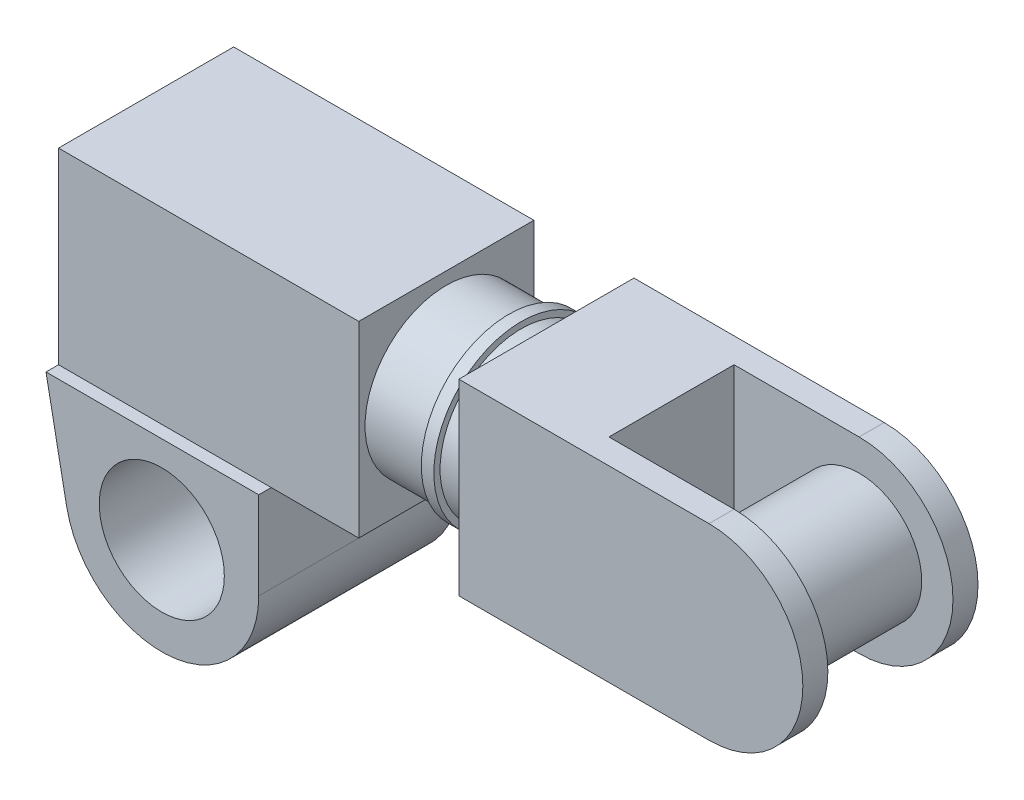
ISO-10303-21;
HEADER;
FILE_DESCRIPTION(('STEP AP214'),'2;1');
FILE_NAME('part.step','',(''),(''),'','','');
FILE_SCHEMA(('AUTOMOTIVE_DESIGN { 1 0 10303 214 1 1 1 1 }'));
ENDSEC;
DATA;
#1=APPLICATION_CONTEXT('core data for automotive mechanical design processes');
#2=APPLICATION_PROTOCOL_DEFINITION('international standard','automotive_design',2000,#1);
#3=PRODUCT_CONTEXT('',#1,'mechanical');
#4=PRODUCT('Part','Part','',(#3));
#5=PRODUCT_RELATED_PRODUCT_CATEGORY('part','',(#4));
#6=PRODUCT_DEFINITION_FORMATION('','',#4);
#7=PRODUCT_DEFINITION_CONTEXT('part definition',#1,'design');
#8=PRODUCT_DEFINITION('design','',#6,#7);
#9=PRODUCT_DEFINITION_SHAPE('','',#8);
#10=(LENGTH_UNIT() NAMED_UNIT(*) SI_UNIT(.MILLI.,.METRE.));
#11=(NAMED_UNIT(*) PLANE_ANGLE_UNIT() SI_UNIT($,.RADIAN.));
#12=(NAMED_UNIT(*) SI_UNIT($,.STERADIAN.) SOLID_ANGLE_UNIT());
#13=UNCERTAINTY_MEASURE_WITH_UNIT(LENGTH_MEASURE(1.E-05),#10,'distance_accuracy_value','');
#14=(GEOMETRIC_REPRESENTATION_CONTEXT(3) GLOBAL_UNCERTAINTY_ASSIGNED_CONTEXT((#13)) GLOBAL_UNIT_ASSIGNED_CONTEXT((#10,
#11,#12)) REPRESENTATION_CONTEXT('',''));
#15=CARTESIAN_POINT('',(0.,0.,0.));
#16=DIRECTION('',(0.,0.,1.));
#17=DIRECTION('',(1.,0.,0.));
#18=AXIS2_PLACEMENT_3D('',#15,#16,#17);
#19=CARTESIAN_POINT('',(240.,75.,-70.));
#20=DIRECTION('',(1.,0.,0.));
#21=DIRECTION('',(0.,0.,-1.));
#22=AXIS2_PLACEMENT_3D('',#19,#20,#21);
#23=PLANE('',#22);
#24=DIRECTION('',(0.,1.,0.));
#25=VECTOR('',#24,1.);
#26=CARTESIAN_POINT('',(240.,75.,-70.));
#27=LINE('',#26,#25);
#28=CARTESIAN_POINT('',(240.,-75.,-70.));
#29=VERTEX_POINT('',#28);
#30=CARTESIAN_POINT('',(240.,75.,-70.));
#31=VERTEX_POINT('',#30);
#32=EDGE_CURVE('E163',#29,#31,#27,.T.);
#33=ORIENTED_EDGE('',*,*,#32,.T.);
#34=DIRECTION('',(0.,0.,1.));
#35=VECTOR('',#34,1.);
#36=CARTESIAN_POINT('',(240.,75.,70.));
#37=LINE('',#36,#35);
#38=CARTESIAN_POINT('',(240.,75.,70.));
#39=VERTEX_POINT('',#38);
#40=EDGE_CURVE('E189',#31,#39,#37,.T.);
#41=ORIENTED_EDGE('',*,*,#40,.T.);
#42=DIRECTION('',(0.,-1.,0.));
#43=VECTOR('',#42,1.);
#44=CARTESIAN_POINT('',(240.,75.,70.));
#45=LINE('',#44,#43);
#46=CARTESIAN_POINT('',(240.,-75.,70.));
#47=VERTEX_POINT('',#46);
#48=EDGE_CURVE('E186',#39,#47,#45,.T.);
#49=ORIENTED_EDGE('',*,*,#48,.T.);
#50=DIRECTION('',(0.,0.,-1.));
#51=VECTOR('',#50,1.);
#52=CARTESIAN_POINT('',(240.,-75.,70.));
#53=LINE('',#52,#51);
#54=EDGE_CURVE('E147',#47,#29,#53,.T.);
#55=ORIENTED_EDGE('',*,*,#54,.T.);
#56=EDGE_LOOP('',(#33,#41,#49,#55));
#57=FACE_BOUND('',#56,.T.);
#58=ADVANCED_FACE('F51',(#57),#23,.T.);
#59=CARTESIAN_POINT('',(240.,75.,-70.));
#60=DIRECTION('',(0.,0.,1.));
#61=DIRECTION('',(0.,-1.,0.));
#62=AXIS2_PLACEMENT_3D('',#59,#60,#61);
#63=PLANE('',#62);
#64=DIRECTION('',(0.,1.,0.));
#65=VECTOR('',#64,1.);
#66=CARTESIAN_POINT('',(0.,75.,-70.));
#67=LINE('',#66,#65);
#68=CARTESIAN_POINT('',(0.,-75.,-70.));
#69=VERTEX_POINT('',#68);
#70=CARTESIAN_POINT('',(0.,75.,-70.));
#71=VERTEX_POINT('',#70);
#72=EDGE_CURVE('E180',#69,#71,#67,.T.);
#73=ORIENTED_EDGE('',*,*,#72,.T.);
#74=DIRECTION('',(-1.,0.,0.));
#75=VECTOR('',#74,1.);
#76=CARTESIAN_POINT('',(240.,75.,-70.));
#77=LINE('',#76,#75);
#78=EDGE_CURVE('E159',#31,#71,#77,.T.);
#79=ORIENTED_EDGE('',*,*,#78,.F.);
#80=ORIENTED_EDGE('',*,*,#32,.F.);
#81=DIRECTION('',(-1.,0.,0.));
#82=VECTOR('',#81,1.);
#83=CARTESIAN_POINT('',(240.,-75.,-70.));
#84=LINE('',#83,#82);
#85=CARTESIAN_POINT('',(170.057165498669,-75.,-70.));
#86=VERTEX_POINT('',#85);
#87=EDGE_CURVE('E148',#29,#86,#84,.T.);
#88=ORIENTED_EDGE('',*,*,#87,.T.);
#89=EDGE_CURVE('E140',#86,#69,#84,.T.);
#90=ORIENTED_EDGE('',*,*,#89,.T.);
#91=EDGE_LOOP('',(#73,#79,#80,#88,#90));
#92=FACE_BOUND('',#91,.T.);
#93=ADVANCED_FACE('F160',(#92),#63,.F.);
#94=CARTESIAN_POINT('',(240.,75.,70.));
#95=DIRECTION('',(0.,-1.,0.));
#96=DIRECTION('',(0.,0.,-1.));
#97=AXIS2_PLACEMENT_3D('',#94,#95,#96);
#98=PLANE('',#97);
#99=DIRECTION('',(0.,0.,1.));
#100=VECTOR('',#99,1.);
#101=CARTESIAN_POINT('',(0.,75.,70.));
#102=LINE('',#101,#100);
#103=CARTESIAN_POINT('',(0.,75.,70.));
#104=VERTEX_POINT('',#103);
#105=EDGE_CURVE('E177',#71,#104,#102,.T.);
#106=ORIENTED_EDGE('',*,*,#105,.T.);
#107=DIRECTION('',(-1.,0.,0.));
#108=VECTOR('',#107,1.);
#109=CARTESIAN_POINT('',(240.,75.,70.));
#110=LINE('',#109,#108);
#111=EDGE_CURVE('E240',#39,#104,#110,.T.);
#112=ORIENTED_EDGE('',*,*,#111,.F.);
#113=ORIENTED_EDGE('',*,*,#40,.F.);
#114=ORIENTED_EDGE('',*,*,#78,.T.);
#115=EDGE_LOOP('',(#106,#112,#113,#114));
#116=FACE_BOUND('',#115,.T.);
#117=ADVANCED_FACE('F249',(#116),#98,.F.);
#118=CARTESIAN_POINT('',(240.,75.,70.));
#119=DIRECTION('',(0.,0.,-1.));
#120=DIRECTION('',(0.,1.,0.));
#121=AXIS2_PLACEMENT_3D('',#118,#119,#120);
#122=PLANE('',#121);
#123=DIRECTION('',(0.,-1.,0.));
#124=VECTOR('',#123,1.);
#125=CARTESIAN_POINT('',(0.,75.,70.));
#126=LINE('',#125,#124);
#127=CARTESIAN_POINT('',(0.,-75.,70.));
#128=VERTEX_POINT('',#127);
#129=EDGE_CURVE('E173',#104,#128,#126,.T.);
#130=ORIENTED_EDGE('',*,*,#129,.T.);
#131=DIRECTION('',(-1.,0.,0.));
#132=VECTOR('',#131,1.);
#133=CARTESIAN_POINT('',(240.,-75.,70.));
#134=LINE('',#133,#132);
#135=CARTESIAN_POINT('',(170.057165498669,-75.,70.));
#136=VERTEX_POINT('',#135);
#137=EDGE_CURVE('E165',#136,#128,#134,.T.);
#138=ORIENTED_EDGE('',*,*,#137,.F.);
#139=EDGE_CURVE('E157',#47,#136,#134,.T.);
#140=ORIENTED_EDGE('',*,*,#139,.F.);
#141=ORIENTED_EDGE('',*,*,#48,.F.);
#142=ORIENTED_EDGE('',*,*,#111,.T.);
#143=EDGE_LOOP('',(#130,#138,#140,#141,#142));
#144=FACE_BOUND('',#143,.T.);
#145=ADVANCED_FACE('F237',(#144),#122,.F.);
#146=CARTESIAN_POINT('',(240.,-75.,70.));
#147=DIRECTION('',(0.,1.,0.));
#148=DIRECTION('',(0.,0.,1.));
#149=AXIS2_PLACEMENT_3D('',#146,#147,#148);
#150=PLANE('',#149);
#151=ORIENTED_EDGE('',*,*,#139,.T.);
#152=DIRECTION('',(0.,0.,-1.));
#153=VECTOR('',#152,1.);
#154=CARTESIAN_POINT('',(170.057165498669,-75.,80.));
#155=LINE('',#154,#153);
#156=EDGE_CURVE('E129',#136,#86,#155,.T.);
#157=ORIENTED_EDGE('',*,*,#156,.T.);
#158=ORIENTED_EDGE('',*,*,#87,.F.);
#159=ORIENTED_EDGE('',*,*,#54,.F.);
#160=EDGE_LOOP('',(#151,#157,#158,#159));
#161=FACE_BOUND('',#160,.T.);
#162=ADVANCED_FACE('F153',(#161),#150,.F.);
#163=CARTESIAN_POINT('',(0.,0.,0.));
#164=DIRECTION('',(1.,0.,0.));
#165=DIRECTION('',(0.,0.,-1.));
#166=AXIS2_PLACEMENT_3D('',#163,#164,#165);
#167=PLANE('',#166);
#168=ORIENTED_EDGE('',*,*,#72,.F.);
#169=DIRECTION('',(0.,0.,-1.));
#170=VECTOR('',#169,1.);
#171=CARTESIAN_POINT('',(0.,-75.,70.));
#172=LINE('',#171,#170);
#173=EDGE_CURVE('E170',#128,#69,#172,.T.);
#174=ORIENTED_EDGE('',*,*,#173,.F.);
#175=ORIENTED_EDGE('',*,*,#129,.F.);
#176=ORIENTED_EDGE('',*,*,#105,.F.);
#177=EDGE_LOOP('',(#168,#174,#175,#176));
#178=FACE_BOUND('',#177,.T.);
#179=ADVANCED_FACE('F242',(#178),#167,.F.);
#180=CARTESIAN_POINT('',(0.,-75.,80.));
#181=DIRECTION('',(0.,-1.,0.));
#182=DIRECTION('',(0.,0.,-1.));
#183=AXIS2_PLACEMENT_3D('',#180,#181,#182);
#184=PLANE('',#183);
#185=CARTESIAN_POINT('',(170.057165498669,-75.,80.));
#186=VERTEX_POINT('',#185);
#187=EDGE_CURVE('E137',#186,#136,#155,.T.);
#188=ORIENTED_EDGE('',*,*,#187,.T.);
#189=ORIENTED_EDGE('',*,*,#137,.T.);
#190=DIRECTION('',(0.,0.,-1.));
#191=VECTOR('',#190,1.);
#192=CARTESIAN_POINT('',(0.,-75.,80.));
#193=LINE('',#192,#191);
#194=CARTESIAN_POINT('',(0.,-75.,80.));
#195=VERTEX_POINT('',#194);
#196=EDGE_CURVE('E183',#195,#128,#193,.T.);
#197=ORIENTED_EDGE('',*,*,#196,.F.);
#198=DIRECTION('',(-1.,0.,0.));
#199=VECTOR('',#198,1.);
#200=CARTESIAN_POINT('',(0.,-75.,80.));
#201=LINE('',#200,#199);
#202=EDGE_CURVE('E207',#186,#195,#201,.T.);
#203=ORIENTED_EDGE('',*,*,#202,.F.);
#204=EDGE_LOOP('',(#188,#189,#197,#203));
#205=FACE_BOUND('',#204,.T.);
#206=ADVANCED_FACE('F230',(#205),#184,.F.);
#207=CARTESIAN_POINT('',(92.5571654986695,-145.,80.));
#208=DIRECTION('',(0.,0.,1.));
#209=DIRECTION('',(1.,0.,0.));
#210=AXIS2_PLACEMENT_3D('',#207,#208,#209);
#211=PLANE('',#210);
#212=ORIENTED_EDGE('',*,*,#202,.T.);
#213=DIRECTION('',(0.190808995376545,-0.981627183447664,0.));
#214=VECTOR('',#213,1.);
#215=CARTESIAN_POINT('',(0.,-75.,80.));
#216=LINE('',#215,#214);
#217=CARTESIAN_POINT('',(16.4810587814755,-159.787697141682,80.));
#218=VERTEX_POINT('',#217);
#219=EDGE_CURVE('E85',#195,#218,#216,.T.);
#220=ORIENTED_EDGE('',*,*,#219,.T.);
#221=CARTESIAN_POINT('',(92.5571654986695,-145.,80.));
#222=DIRECTION('',(0.,0.,1.));
#223=DIRECTION('',(1.,0.,0.));
#224=AXIS2_PLACEMENT_3D('',#221,#222,#223);
#225=CIRCLE('',#224,77.5);
#226=CARTESIAN_POINT('',(170.057165498669,-145.,80.));
#227=VERTEX_POINT('',#226);
#228=EDGE_CURVE('E218',#218,#227,#225,.T.);
#229=ORIENTED_EDGE('',*,*,#228,.T.);
#230=DIRECTION('',(0.,1.,0.));
#231=VECTOR('',#230,1.);
#232=CARTESIAN_POINT('',(170.057165498669,-75.,80.));
#233=LINE('',#232,#231);
#234=EDGE_CURVE('E136',#227,#186,#233,.T.);
#235=ORIENTED_EDGE('',*,*,#234,.T.);
#236=EDGE_LOOP('',(#212,#220,#229,#235));
#237=FACE_BOUND('',#236,.T.);
#238=CARTESIAN_POINT('',(92.5571654986695,-145.,80.));
#239=DIRECTION('',(0.,0.,1.));
#240=DIRECTION('',(1.,0.,0.));
#241=AXIS2_PLACEMENT_3D('',#238,#239,#240);
#242=CIRCLE('',#241,50.);
#243=CARTESIAN_POINT('',(142.557165498669,-145.,80.));
#244=VERTEX_POINT('',#243);
#245=EDGE_CURVE('E54',#244,#244,#242,.T.);
#246=ORIENTED_EDGE('',*,*,#245,.F.);
#247=EDGE_LOOP('',(#246));
#248=FACE_BOUND('',#247,.T.);
#249=ADVANCED_FACE('F226',(#237,#248),#211,.T.);
#250=CARTESIAN_POINT('',(92.5571654986695,-145.,-80.));
#251=DIRECTION('',(0.,0.,1.));
#252=DIRECTION('',(1.,0.,0.));
#253=AXIS2_PLACEMENT_3D('',#250,#251,#252);
#254=PLANE('',#253);
#255=DIRECTION('',(-1.,0.,0.));
#256=VECTOR('',#255,1.);
#257=CARTESIAN_POINT('',(0.,-75.,-80.));
#258=LINE('',#257,#256);
#259=CARTESIAN_POINT('',(170.057165498669,-75.,-80.));
#260=VERTEX_POINT('',#259);
#261=CARTESIAN_POINT('',(0.,-75.,-80.));
#262=VERTEX_POINT('',#261);
#263=EDGE_CURVE('E213',#260,#262,#258,.T.);
#264=ORIENTED_EDGE('',*,*,#263,.F.);
#265=DIRECTION('',(0.,1.,0.));
#266=VECTOR('',#265,1.);
#267=CARTESIAN_POINT('',(170.057165498669,-75.,-80.));
#268=LINE('',#267,#266);
#269=CARTESIAN_POINT('',(170.057165498669,-145.,-80.));
#270=VERTEX_POINT('',#269);
#271=EDGE_CURVE('E133',#270,#260,#268,.T.);
#272=ORIENTED_EDGE('',*,*,#271,.F.);
#273=CARTESIAN_POINT('',(92.5571654986695,-145.,-80.));
#274=DIRECTION('',(0.,0.,1.));
#275=DIRECTION('',(1.,0.,0.));
#276=AXIS2_PLACEMENT_3D('',#273,#274,#275);
#277=CIRCLE('',#276,77.5);
#278=CARTESIAN_POINT('',(16.4810587814755,-159.787697141682,-80.));
#279=VERTEX_POINT('',#278);
#280=EDGE_CURVE('E206',#279,#270,#277,.T.);
#281=ORIENTED_EDGE('',*,*,#280,.F.);
#282=DIRECTION('',(0.190808995376545,-0.981627183447664,0.));
#283=VECTOR('',#282,1.);
#284=CARTESIAN_POINT('',(0.,-75.,-80.));
#285=LINE('',#284,#283);
#286=EDGE_CURVE('E210',#262,#279,#285,.T.);
#287=ORIENTED_EDGE('',*,*,#286,.F.);
#288=EDGE_LOOP('',(#264,#272,#281,#287));
#289=FACE_BOUND('',#288,.T.);
#290=CARTESIAN_POINT('',(92.5571654986695,-145.,-80.));
#291=DIRECTION('',(0.,0.,1.));
#292=DIRECTION('',(1.,0.,0.));
#293=AXIS2_PLACEMENT_3D('',#290,#291,#292);
#294=CIRCLE('',#293,50.);
#295=CARTESIAN_POINT('',(142.557165498669,-145.,-80.));
#296=VERTEX_POINT('',#295);
#297=EDGE_CURVE('E12',#296,#296,#294,.T.);
#298=ORIENTED_EDGE('',*,*,#297,.T.);
#299=EDGE_LOOP('',(#298));
#300=FACE_BOUND('',#299,.T.);
#301=ADVANCED_FACE('F269',(#289,#300),#254,.F.);
#302=ORIENTED_EDGE('',*,*,#89,.F.);
#303=EDGE_CURVE('E95',#86,#260,#155,.T.);
#304=ORIENTED_EDGE('',*,*,#303,.T.);
#305=ORIENTED_EDGE('',*,*,#263,.T.);
#306=EDGE_CURVE('E68',#69,#262,#193,.T.);
#307=ORIENTED_EDGE('',*,*,#306,.F.);
#308=EDGE_LOOP('',(#302,#304,#305,#307));
#309=FACE_BOUND('',#308,.T.);
#310=ADVANCED_FACE('F141',(#309),#184,.F.);
#311=CARTESIAN_POINT('',(0.,-75.,80.));
#312=DIRECTION('',(0.981627183447664,0.190808995376545,0.));
#313=DIRECTION('',(-0.190808995376545,0.981627183447664,0.));
#314=AXIS2_PLACEMENT_3D('',#311,#312,#313);
#315=PLANE('',#314);
#316=ORIENTED_EDGE('',*,*,#286,.T.);
#317=DIRECTION('',(0.,0.,-1.));
#318=VECTOR('',#317,1.);
#319=CARTESIAN_POINT('',(16.4810587814755,-159.787697141682,80.));
#320=LINE('',#319,#318);
#321=EDGE_CURVE('E196',#218,#279,#320,.T.);
#322=ORIENTED_EDGE('',*,*,#321,.F.);
#323=ORIENTED_EDGE('',*,*,#219,.F.);
#324=ORIENTED_EDGE('',*,*,#196,.T.);
#325=ORIENTED_EDGE('',*,*,#173,.T.);
#326=ORIENTED_EDGE('',*,*,#306,.T.);
#327=EDGE_LOOP('',(#316,#322,#323,#324,#325,#326));
#328=FACE_BOUND('',#327,.T.);
#329=ADVANCED_FACE('F232',(#328),#315,.F.);
#330=CARTESIAN_POINT('',(92.5571654986695,-145.,80.));
#331=DIRECTION('',(0.,0.,-1.));
#332=DIRECTION('',(-1.,0.,0.));
#333=AXIS2_PLACEMENT_3D('',#330,#331,#332);
#334=CYLINDRICAL_SURFACE('',#333,77.5);
#335=ORIENTED_EDGE('',*,*,#280,.T.);
#336=DIRECTION('',(0.,0.,-1.));
#337=VECTOR('',#336,1.);
#338=CARTESIAN_POINT('',(170.057165498669,-145.,80.));
#339=LINE('',#338,#337);
#340=EDGE_CURVE('E200',#227,#270,#339,.T.);
#341=ORIENTED_EDGE('',*,*,#340,.F.);
#342=ORIENTED_EDGE('',*,*,#228,.F.);
#343=ORIENTED_EDGE('',*,*,#321,.T.);
#344=EDGE_LOOP('',(#335,#341,#342,#343));
#345=FACE_BOUND('',#344,.T.);
#346=ADVANCED_FACE('F262',(#345),#334,.T.);
#347=CARTESIAN_POINT('',(170.057165498669,-75.,80.));
#348=DIRECTION('',(-1.,0.,0.));
#349=DIRECTION('',(0.,0.,1.));
#350=AXIS2_PLACEMENT_3D('',#347,#348,#349);
#351=PLANE('',#350);
#352=ORIENTED_EDGE('',*,*,#271,.T.);
#353=ORIENTED_EDGE('',*,*,#303,.F.);
#354=ORIENTED_EDGE('',*,*,#156,.F.);
#355=ORIENTED_EDGE('',*,*,#187,.F.);
#356=ORIENTED_EDGE('',*,*,#234,.F.);
#357=ORIENTED_EDGE('',*,*,#340,.T.);
#358=EDGE_LOOP('',(#352,#353,#354,#355,#356,#357));
#359=FACE_BOUND('',#358,.T.);
#360=ADVANCED_FACE('F126',(#359),#351,.F.);
#361=CARTESIAN_POINT('',(92.5571654986695,-145.,80.));
#362=DIRECTION('',(0.,0.,-1.));
#363=DIRECTION('',(-1.,0.,0.));
#364=AXIS2_PLACEMENT_3D('',#361,#362,#363);
#365=CYLINDRICAL_SURFACE('',#364,50.);
#366=ORIENTED_EDGE('',*,*,#245,.T.);
#367=EDGE_LOOP('',(#366));
#368=FACE_BOUND('',#367,.T.);
#369=ORIENTED_EDGE('',*,*,#297,.F.);
#370=EDGE_LOOP('',(#369));
#371=FACE_BOUND('',#370,.T.);
#372=ADVANCED_FACE('F252',(#368,#371),#365,.F.);
#373=CLOSED_SHELL('',(#58,#93,#117,#145,#162,#179,#206,#249,#301,#310,#329,#346,#360,#372));
#374=MANIFOLD_SOLID_BREP('B2',#373);
#375=CARTESIAN_POINT('',(240.,75.,-70.));
#376=DIRECTION('',(1.,0.,0.));
#377=DIRECTION('',(0.,0.,-1.));
#378=AXIS2_PLACEMENT_3D('',#375,#376,#377);
#379=PLANE('',#378);
#380=CARTESIAN_POINT('',(240.,0.,0.));
#381=DIRECTION('',(1.,0.,0.));
#382=DIRECTION('',(0.,0.,-1.));
#383=AXIS2_PLACEMENT_3D('',#380,#381,#382);
#384=CIRCLE('',#383,65.);
#385=CARTESIAN_POINT('',(240.,0.,-65.));
#386=VERTEX_POINT('',#385);
#387=EDGE_CURVE('E508',#386,#386,#384,.T.);
#388=ORIENTED_EDGE('',*,*,#387,.F.);
#389=EDGE_LOOP('',(#388));
#390=FACE_BOUND('',#389,.T.);
#391=ADVANCED_FACE('F398',(#390),#379,.F.);
#392=CARTESIAN_POINT('',(520.,0.,80.002));
#393=DIRECTION('',(0.,0.,-1.));
#394=DIRECTION('',(-1.,0.,0.));
#395=AXIS2_PLACEMENT_3D('',#392,#393,#394);
#396=CYLINDRICAL_SURFACE('',#395,50.);
#397=CARTESIAN_POINT('',(520.,0.,-50.));
#398=DIRECTION('',(0.,0.,1.));
#399=DIRECTION('',(1.,0.,0.));
#400=AXIS2_PLACEMENT_3D('',#397,#398,#399);
#401=CIRCLE('',#400,50.);
#402=CARTESIAN_POINT('',(570.,0.,-50.));
#403=VERTEX_POINT('',#402);
#404=EDGE_CURVE('E586',#403,#403,#401,.T.);
#405=ORIENTED_EDGE('',*,*,#404,.T.);
#406=EDGE_LOOP('',(#405));
#407=FACE_BOUND('',#406,.T.);
#408=CARTESIAN_POINT('',(520.,0.,50.));
#409=DIRECTION('',(0.,0.,1.));
#410=DIRECTION('',(1.,0.,0.));
#411=AXIS2_PLACEMENT_3D('',#408,#409,#410);
#412=CIRCLE('',#411,50.);
#413=CARTESIAN_POINT('',(570.,0.,50.));
#414=VERTEX_POINT('',#413);
#415=EDGE_CURVE('E49',#414,#414,#412,.F.);
#416=ORIENTED_EDGE('',*,*,#415,.T.);
#417=EDGE_LOOP('',(#416));
#418=FACE_BOUND('',#417,.T.);
#419=ADVANCED_FACE('F522',(#407,#418),#396,.T.);
#420=CARTESIAN_POINT('',(520.,0.,70.));
#421=DIRECTION('',(0.,0.,-1.));
#422=DIRECTION('',(-1.,0.,0.));
#423=AXIS2_PLACEMENT_3D('',#420,#421,#422);
#424=CYLINDRICAL_SURFACE('',#423,75.);
#425=DIRECTION('',(0.,0.,-1.));
#426=VECTOR('',#425,1.);
#427=CARTESIAN_POINT('',(520.,-75.,70.));
#428=LINE('',#427,#426);
#429=CARTESIAN_POINT('',(520.,-75.,70.));
#430=VERTEX_POINT('',#429);
#431=CARTESIAN_POINT('',(520.,-75.,50.));
#432=VERTEX_POINT('',#431);
#433=EDGE_CURVE('E614',#430,#432,#428,.T.);
#434=ORIENTED_EDGE('',*,*,#433,.T.);
#435=CARTESIAN_POINT('',(520.,0.,50.));
#436=DIRECTION('',(0.,0.,1.));
#437=DIRECTION('',(1.,0.,0.));
#438=AXIS2_PLACEMENT_3D('',#435,#436,#437);
#439=CIRCLE('',#438,75.);
#440=CARTESIAN_POINT('',(520.,75.,50.));
#441=VERTEX_POINT('',#440);
#442=EDGE_CURVE('E412',#432,#441,#439,.T.);
#443=ORIENTED_EDGE('',*,*,#442,.T.);
#444=DIRECTION('',(0.,0.,-1.));
#445=VECTOR('',#444,1.);
#446=CARTESIAN_POINT('',(520.,75.,70.));
#447=LINE('',#446,#445);
#448=CARTESIAN_POINT('',(520.,75.,70.));
#449=VERTEX_POINT('',#448);
#450=EDGE_CURVE('E494',#449,#441,#447,.T.);
#451=ORIENTED_EDGE('',*,*,#450,.F.);
#452=CARTESIAN_POINT('',(520.,0.,70.));
#453=DIRECTION('',(0.,0.,1.));
#454=DIRECTION('',(1.,0.,0.));
#455=AXIS2_PLACEMENT_3D('',#452,#453,#454);
#456=CIRCLE('',#455,75.);
#457=EDGE_CURVE('E601',#430,#449,#456,.T.);
#458=ORIENTED_EDGE('',*,*,#457,.F.);
#459=EDGE_LOOP('',(#434,#443,#451,#458));
#460=FACE_BOUND('',#459,.T.);
#461=ADVANCED_FACE('F526',(#460),#424,.T.);
#462=CARTESIAN_POINT('',(520.,0.,50.));
#463=DIRECTION('',(0.,0.,1.));
#464=DIRECTION('',(1.,0.,0.));
#465=AXIS2_PLACEMENT_3D('',#462,#463,#464);
#466=PLANE('',#465);
#467=ORIENTED_EDGE('',*,*,#415,.F.);
#468=EDGE_LOOP('',(#467));
#469=FACE_BOUND('',#468,.T.);
#470=ORIENTED_EDGE('',*,*,#442,.F.);
#471=DIRECTION('',(1.,0.,0.));
#472=VECTOR('',#471,1.);
#473=CARTESIAN_POINT('',(420.,-75.,50.));
#474=LINE('',#473,#472);
#475=CARTESIAN_POINT('',(420.,-75.,50.));
#476=VERTEX_POINT('',#475);
#477=EDGE_CURVE('E482',#476,#432,#474,.T.);
#478=ORIENTED_EDGE('',*,*,#477,.F.);
#479=DIRECTION('',(0.,-1.,0.));
#480=VECTOR('',#479,1.);
#481=CARTESIAN_POINT('',(420.,75.,50.));
#482=LINE('',#481,#480);
#483=CARTESIAN_POINT('',(420.,75.,50.));
#484=VERTEX_POINT('',#483);
#485=EDGE_CURVE('E594',#484,#476,#482,.T.);
#486=ORIENTED_EDGE('',*,*,#485,.F.);
#487=DIRECTION('',(-1.,0.,0.));
#488=VECTOR('',#487,1.);
#489=CARTESIAN_POINT('',(520.,75.,50.));
#490=LINE('',#489,#488);
#491=EDGE_CURVE('E588',#441,#484,#490,.T.);
#492=ORIENTED_EDGE('',*,*,#491,.F.);
#493=EDGE_LOOP('',(#470,#478,#486,#492));
#494=FACE_BOUND('',#493,.T.);
#495=ADVANCED_FACE('F554',(#469,#494),#466,.F.);
#496=CARTESIAN_POINT('',(420.,75.,-50.));
#497=DIRECTION('',(-1.,0.,0.));
#498=DIRECTION('',(0.,-1.,0.));
#499=AXIS2_PLACEMENT_3D('',#496,#497,#498);
#500=PLANE('',#499);
#501=ORIENTED_EDGE('',*,*,#485,.T.);
#502=DIRECTION('',(0.,0.,1.));
#503=VECTOR('',#502,1.);
#504=CARTESIAN_POINT('',(420.,-75.,-50.));
#505=LINE('',#504,#503);
#506=CARTESIAN_POINT('',(420.,-75.,-50.));
#507=VERTEX_POINT('',#506);
#508=EDGE_CURVE('E597',#507,#476,#505,.T.);
#509=ORIENTED_EDGE('',*,*,#508,.F.);
#510=DIRECTION('',(0.,-1.,0.));
#511=VECTOR('',#510,1.);
#512=CARTESIAN_POINT('',(420.,75.,-50.));
#513=LINE('',#512,#511);
#514=CARTESIAN_POINT('',(420.,75.,-50.));
#515=VERTEX_POINT('',#514);
#516=EDGE_CURVE('E489',#515,#507,#513,.T.);
#517=ORIENTED_EDGE('',*,*,#516,.F.);
#518=DIRECTION('',(0.,0.,1.));
#519=VECTOR('',#518,1.);
#520=CARTESIAN_POINT('',(420.,75.,-50.));
#521=LINE('',#520,#519);
#522=EDGE_CURVE('E488',#515,#484,#521,.T.);
#523=ORIENTED_EDGE('',*,*,#522,.T.);
#524=EDGE_LOOP('',(#501,#509,#517,#523));
#525=FACE_BOUND('',#524,.T.);
#526=ADVANCED_FACE('F572',(#525),#500,.F.);
#527=CARTESIAN_POINT('',(520.,0.,-50.));
#528=DIRECTION('',(0.,0.,1.));
#529=DIRECTION('',(1.,0.,0.));
#530=AXIS2_PLACEMENT_3D('',#527,#528,#529);
#531=PLANE('',#530);
#532=ORIENTED_EDGE('',*,*,#404,.F.);
#533=EDGE_LOOP('',(#532));
#534=FACE_BOUND('',#533,.T.);
#535=CARTESIAN_POINT('',(520.,0.,-50.));
#536=DIRECTION('',(0.,0.,1.));
#537=DIRECTION('',(1.,0.,0.));
#538=AXIS2_PLACEMENT_3D('',#535,#536,#537);
#539=CIRCLE('',#538,75.);
#540=CARTESIAN_POINT('',(520.,-75.,-50.));
#541=VERTEX_POINT('',#540);
#542=CARTESIAN_POINT('',(520.,75.,-50.));
#543=VERTEX_POINT('',#542);
#544=EDGE_CURVE('E473',#541,#543,#539,.T.);
#545=ORIENTED_EDGE('',*,*,#544,.T.);
#546=DIRECTION('',(-1.,0.,0.));
#547=VECTOR('',#546,1.);
#548=CARTESIAN_POINT('',(520.,75.,-50.));
#549=LINE('',#548,#547);
#550=EDGE_CURVE('E477',#543,#515,#549,.T.);
#551=ORIENTED_EDGE('',*,*,#550,.T.);
#552=ORIENTED_EDGE('',*,*,#516,.T.);
#553=DIRECTION('',(1.,0.,0.));
#554=VECTOR('',#553,1.);
#555=CARTESIAN_POINT('',(420.,-75.,-50.));
#556=LINE('',#555,#554);
#557=EDGE_CURVE('E480',#507,#541,#556,.T.);
#558=ORIENTED_EDGE('',*,*,#557,.T.);
#559=EDGE_LOOP('',(#545,#551,#552,#558));
#560=FACE_BOUND('',#559,.T.);
#561=ADVANCED_FACE('F475',(#534,#560),#531,.T.);
#562=ORIENTED_EDGE('',*,*,#544,.F.);
#563=CARTESIAN_POINT('',(520.,-75.,-70.));
#564=VERTEX_POINT('',#563);
#565=EDGE_CURVE('E443',#541,#564,#428,.T.);
#566=ORIENTED_EDGE('',*,*,#565,.T.);
#567=CARTESIAN_POINT('',(520.,0.,-70.));
#568=DIRECTION('',(0.,0.,1.));
#569=DIRECTION('',(1.,0.,0.));
#570=AXIS2_PLACEMENT_3D('',#567,#568,#569);
#571=CIRCLE('',#570,75.);
#572=CARTESIAN_POINT('',(520.,75.,-70.));
#573=VERTEX_POINT('',#572);
#574=EDGE_CURVE('E493',#564,#573,#571,.T.);
#575=ORIENTED_EDGE('',*,*,#574,.T.);
#576=EDGE_CURVE('E485',#543,#573,#447,.T.);
#577=ORIENTED_EDGE('',*,*,#576,.F.);
#578=EDGE_LOOP('',(#562,#566,#575,#577));
#579=FACE_BOUND('',#578,.T.);
#580=ADVANCED_FACE('F491',(#579),#424,.T.);
#581=CARTESIAN_POINT('',(520.,75.,70.));
#582=DIRECTION('',(0.,-1.,0.));
#583=DIRECTION('',(1.,0.,0.));
#584=AXIS2_PLACEMENT_3D('',#581,#582,#583);
#585=PLANE('',#584);
#586=ORIENTED_EDGE('',*,*,#550,.F.);
#587=ORIENTED_EDGE('',*,*,#576,.T.);
#588=DIRECTION('',(-1.,0.,0.));
#589=VECTOR('',#588,1.);
#590=CARTESIAN_POINT('',(520.,75.,-70.));
#591=LINE('',#590,#589);
#592=CARTESIAN_POINT('',(320.,75.,-70.));
#593=VERTEX_POINT('',#592);
#594=EDGE_CURVE('E609',#573,#593,#591,.T.);
#595=ORIENTED_EDGE('',*,*,#594,.T.);
#596=DIRECTION('',(0.,0.,-1.));
#597=VECTOR('',#596,1.);
#598=CARTESIAN_POINT('',(320.,75.,70.));
#599=LINE('',#598,#597);
#600=CARTESIAN_POINT('',(320.,75.,70.));
#601=VERTEX_POINT('',#600);
#602=EDGE_CURVE('E495',#601,#593,#599,.T.);
#603=ORIENTED_EDGE('',*,*,#602,.F.);
#604=DIRECTION('',(-1.,0.,0.));
#605=VECTOR('',#604,1.);
#606=CARTESIAN_POINT('',(520.,75.,70.));
#607=LINE('',#606,#605);
#608=EDGE_CURVE('E451',#449,#601,#607,.T.);
#609=ORIENTED_EDGE('',*,*,#608,.F.);
#610=ORIENTED_EDGE('',*,*,#450,.T.);
#611=ORIENTED_EDGE('',*,*,#491,.T.);
#612=ORIENTED_EDGE('',*,*,#522,.F.);
#613=EDGE_LOOP('',(#586,#587,#595,#603,#609,#610,#611,#612));
#614=FACE_BOUND('',#613,.T.);
#615=ADVANCED_FACE('F484',(#614),#585,.F.);
#616=CARTESIAN_POINT('',(520.,0.,70.));
#617=DIRECTION('',(0.,0.,1.));
#618=DIRECTION('',(1.,0.,0.));
#619=AXIS2_PLACEMENT_3D('',#616,#617,#618);
#620=PLANE('',#619);
#621=ORIENTED_EDGE('',*,*,#457,.T.);
#622=ORIENTED_EDGE('',*,*,#608,.T.);
#623=DIRECTION('',(0.,-1.,0.));
#624=VECTOR('',#623,1.);
#625=CARTESIAN_POINT('',(320.,75.,70.));
#626=LINE('',#625,#624);
#627=CARTESIAN_POINT('',(320.,-75.,70.));
#628=VERTEX_POINT('',#627);
#629=EDGE_CURVE('E605',#601,#628,#626,.T.);
#630=ORIENTED_EDGE('',*,*,#629,.T.);
#631=DIRECTION('',(1.,0.,0.));
#632=VECTOR('',#631,1.);
#633=CARTESIAN_POINT('',(320.,-75.,70.));
#634=LINE('',#633,#632);
#635=EDGE_CURVE('E421',#628,#430,#634,.T.);
#636=ORIENTED_EDGE('',*,*,#635,.T.);
#637=EDGE_LOOP('',(#621,#622,#630,#636));
#638=FACE_BOUND('',#637,.T.);
#639=ADVANCED_FACE('F558',(#638),#620,.T.);
#640=CARTESIAN_POINT('',(320.,-75.,70.));
#641=DIRECTION('',(0.,1.,0.));
#642=DIRECTION('',(-1.,0.,0.));
#643=AXIS2_PLACEMENT_3D('',#640,#641,#642);
#644=PLANE('',#643);
#645=ORIENTED_EDGE('',*,*,#557,.F.);
#646=ORIENTED_EDGE('',*,*,#508,.T.);
#647=ORIENTED_EDGE('',*,*,#477,.T.);
#648=ORIENTED_EDGE('',*,*,#433,.F.);
#649=ORIENTED_EDGE('',*,*,#635,.F.);
#650=DIRECTION('',(0.,0.,-1.));
#651=VECTOR('',#650,1.);
#652=CARTESIAN_POINT('',(320.,-75.,70.));
#653=LINE('',#652,#651);
#654=CARTESIAN_POINT('',(320.,-75.,-70.));
#655=VERTEX_POINT('',#654);
#656=EDGE_CURVE('E499',#628,#655,#653,.T.);
#657=ORIENTED_EDGE('',*,*,#656,.T.);
#658=DIRECTION('',(1.,0.,0.));
#659=VECTOR('',#658,1.);
#660=CARTESIAN_POINT('',(320.,-75.,-70.));
#661=LINE('',#660,#659);
#662=EDGE_CURVE('E603',#655,#564,#661,.T.);
#663=ORIENTED_EDGE('',*,*,#662,.T.);
#664=ORIENTED_EDGE('',*,*,#565,.F.);
#665=EDGE_LOOP('',(#645,#646,#647,#648,#649,#657,#663,#664));
#666=FACE_BOUND('',#665,.T.);
#667=ADVANCED_FACE('F563',(#666),#644,.F.);
#668=CARTESIAN_POINT('',(520.,0.,-70.));
#669=DIRECTION('',(0.,0.,1.));
#670=DIRECTION('',(1.,0.,0.));
#671=AXIS2_PLACEMENT_3D('',#668,#669,#670);
#672=PLANE('',#671);
#673=ORIENTED_EDGE('',*,*,#574,.F.);
#674=ORIENTED_EDGE('',*,*,#662,.F.);
#675=DIRECTION('',(0.,-1.,0.));
#676=VECTOR('',#675,1.);
#677=CARTESIAN_POINT('',(320.,75.,-70.));
#678=LINE('',#677,#676);
#679=EDGE_CURVE('E611',#593,#655,#678,.T.);
#680=ORIENTED_EDGE('',*,*,#679,.F.);
#681=ORIENTED_EDGE('',*,*,#594,.F.);
#682=EDGE_LOOP('',(#673,#674,#680,#681));
#683=FACE_BOUND('',#682,.T.);
#684=ADVANCED_FACE('F561',(#683),#672,.F.);
#685=CARTESIAN_POINT('',(320.,75.,70.));
#686=DIRECTION('',(1.,0.,0.));
#687=DIRECTION('',(0.,1.,0.));
#688=AXIS2_PLACEMENT_3D('',#685,#686,#687);
#689=PLANE('',#688);
#690=CARTESIAN_POINT('',(320.,0.,0.));
#691=DIRECTION('',(1.,0.,0.));
#692=DIRECTION('',(0.,0.,-1.));
#693=AXIS2_PLACEMENT_3D('',#690,#691,#692);
#694=CIRCLE('',#693,65.);
#695=CARTESIAN_POINT('',(320.,0.,-65.));
#696=VERTEX_POINT('',#695);
#697=EDGE_CURVE('E497',#696,#696,#694,.T.);
#698=ORIENTED_EDGE('',*,*,#697,.T.);
#699=EDGE_LOOP('',(#698));
#700=FACE_BOUND('',#699,.T.);
#701=ORIENTED_EDGE('',*,*,#679,.T.);
#702=ORIENTED_EDGE('',*,*,#656,.F.);
#703=ORIENTED_EDGE('',*,*,#629,.F.);
#704=ORIENTED_EDGE('',*,*,#602,.T.);
#705=EDGE_LOOP('',(#701,#702,#703,#704));
#706=FACE_BOUND('',#705,.T.);
#707=ADVANCED_FACE('F550',(#700,#706),#689,.F.);
#708=CARTESIAN_POINT('',(320.,0.,0.));
#709=DIRECTION('',(-1.,0.,0.));
#710=DIRECTION('',(0.,0.,1.));
#711=AXIS2_PLACEMENT_3D('',#708,#709,#710);
#712=CYLINDRICAL_SURFACE('',#711,65.);
#713=ORIENTED_EDGE('',*,*,#697,.F.);
#714=EDGE_LOOP('',(#713));
#715=FACE_BOUND('',#714,.T.);
#716=CARTESIAN_POINT('',(300.,0.,0.));
#717=DIRECTION('',(1.,0.,0.));
#718=DIRECTION('',(0.,0.,-1.));
#719=AXIS2_PLACEMENT_3D('',#716,#717,#718);
#720=CIRCLE('',#719,65.);
#721=CARTESIAN_POINT('',(300.,0.,-65.));
#722=VERTEX_POINT('',#721);
#723=EDGE_CURVE('E405',#722,#722,#720,.T.);
#724=ORIENTED_EDGE('',*,*,#723,.T.);
#725=EDGE_LOOP('',(#724));
#726=FACE_BOUND('',#725,.T.);
#727=ADVANCED_FACE('F546',(#715,#726),#712,.T.);
#728=CARTESIAN_POINT('',(300.,0.,0.));
#729=DIRECTION('',(1.,0.,0.));
#730=DIRECTION('',(0.,0.,-1.));
#731=AXIS2_PLACEMENT_3D('',#728,#729,#730);
#732=PLANE('',#731);
#733=ORIENTED_EDGE('',*,*,#723,.F.);
#734=EDGE_LOOP('',(#733));
#735=FACE_BOUND('',#734,.T.);
#736=CARTESIAN_POINT('',(300.,0.,0.));
#737=DIRECTION('',(1.,0.,0.));
#738=DIRECTION('',(0.,0.,-1.));
#739=AXIS2_PLACEMENT_3D('',#736,#737,#738);
#740=CIRCLE('',#739,70.);
#741=CARTESIAN_POINT('',(300.,0.,-70.));
#742=VERTEX_POINT('',#741);
#743=EDGE_CURVE('E509',#742,#742,#740,.T.);
#744=ORIENTED_EDGE('',*,*,#743,.T.);
#745=EDGE_LOOP('',(#744));
#746=FACE_BOUND('',#745,.T.);
#747=ADVANCED_FACE('F541',(#735,#746),#732,.T.);
#748=CARTESIAN_POINT('',(300.,0.,0.));
#749=DIRECTION('',(-1.,0.,0.));
#750=DIRECTION('',(0.,0.,1.));
#751=AXIS2_PLACEMENT_3D('',#748,#749,#750);
#752=CYLINDRICAL_SURFACE('',#751,70.);
#753=ORIENTED_EDGE('',*,*,#743,.F.);
#754=EDGE_LOOP('',(#753));
#755=FACE_BOUND('',#754,.T.);
#756=CARTESIAN_POINT('',(290.,0.,0.));
#757=DIRECTION('',(1.,0.,0.));
#758=DIRECTION('',(0.,0.,-1.));
#759=AXIS2_PLACEMENT_3D('',#756,#757,#758);
#760=CIRCLE('',#759,70.);
#761=CARTESIAN_POINT('',(290.,0.,-70.));
#762=VERTEX_POINT('',#761);
#763=EDGE_CURVE('E505',#762,#762,#760,.T.);
#764=ORIENTED_EDGE('',*,*,#763,.T.);
#765=EDGE_LOOP('',(#764));
#766=FACE_BOUND('',#765,.T.);
#767=ADVANCED_FACE('F535',(#755,#766),#752,.T.);
#768=CARTESIAN_POINT('',(290.,0.,0.));
#769=DIRECTION('',(1.,0.,0.));
#770=DIRECTION('',(0.,0.,-1.));
#771=AXIS2_PLACEMENT_3D('',#768,#769,#770);
#772=PLANE('',#771);
#773=CARTESIAN_POINT('',(290.,0.,0.));
#774=DIRECTION('',(1.,0.,0.));
#775=DIRECTION('',(0.,0.,-1.));
#776=AXIS2_PLACEMENT_3D('',#773,#774,#775);
#777=CIRCLE('',#776,65.);
#778=CARTESIAN_POINT('',(290.,0.,-65.));
#779=VERTEX_POINT('',#778);
#780=EDGE_CURVE('E512',#779,#779,#777,.T.);
#781=ORIENTED_EDGE('',*,*,#780,.T.);
#782=EDGE_LOOP('',(#781));
#783=FACE_BOUND('',#782,.T.);
#784=ORIENTED_EDGE('',*,*,#763,.F.);
#785=EDGE_LOOP('',(#784));
#786=FACE_BOUND('',#785,.T.);
#787=ADVANCED_FACE('F530',(#783,#786),#772,.F.);
#788=CARTESIAN_POINT('',(290.,0.,0.));
#789=DIRECTION('',(-1.,0.,0.));
#790=DIRECTION('',(0.,0.,1.));
#791=AXIS2_PLACEMENT_3D('',#788,#789,#790);
#792=CYLINDRICAL_SURFACE('',#791,65.);
#793=ORIENTED_EDGE('',*,*,#780,.F.);
#794=EDGE_LOOP('',(#793));
#795=FACE_BOUND('',#794,.T.);
#796=ORIENTED_EDGE('',*,*,#387,.T.);
#797=EDGE_LOOP('',(#796));
#798=FACE_BOUND('',#797,.T.);
#799=ADVANCED_FACE('F519',(#795,#798),#792,.T.);
#800=CLOSED_SHELL('',(#391,#419,#461,#495,#526,#561,#580,#615,#639,#667,#684,#707,#727,#747,
#767,#787,#799));
#801=MANIFOLD_SOLID_BREP('B6',#800);
#802=ADVANCED_BREP_SHAPE_REPRESENTATION('',(#18,#374,#801),#14);
#803=SHAPE_DEFINITION_REPRESENTATION(#9,#802);
ENDSEC;
END-ISO-10303-21;
